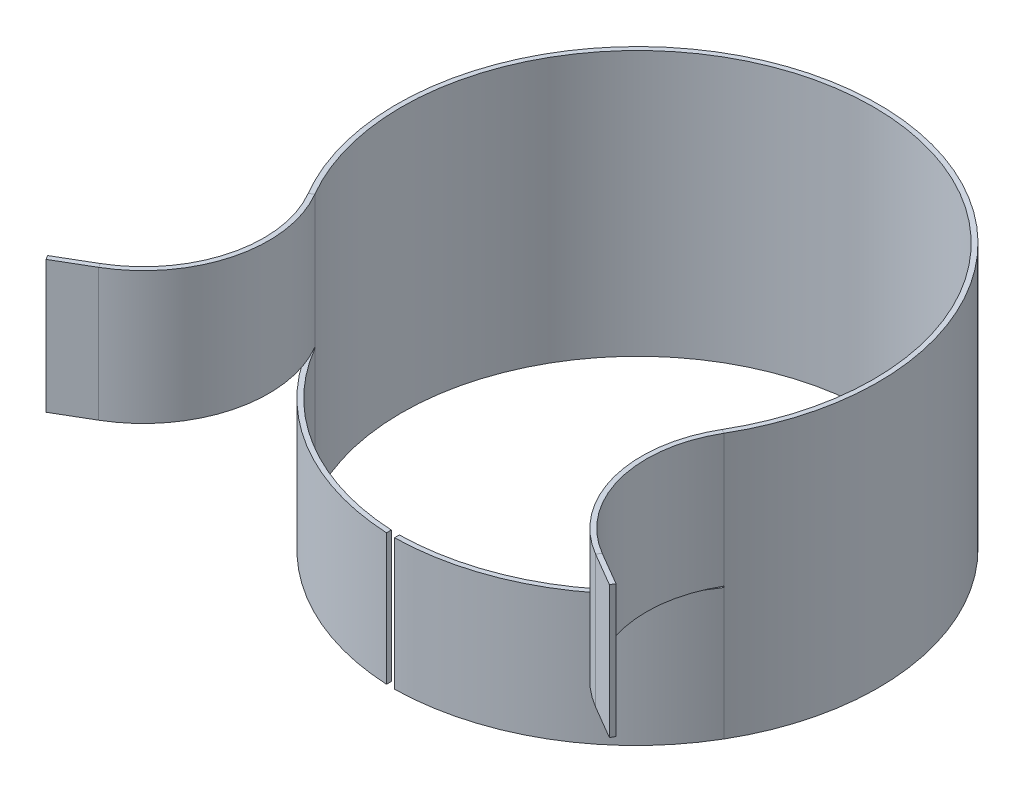
ISO-10303-21;
HEADER;
FILE_DESCRIPTION(('STEP AP214'),'2;1');
FILE_NAME('part.step','',(''),(''),'','','');
FILE_SCHEMA(('AUTOMOTIVE_DESIGN { 1 0 10303 214 1 1 1 1 }'));
ENDSEC;
DATA;
#1=APPLICATION_CONTEXT('core data for automotive mechanical design processes');
#2=APPLICATION_PROTOCOL_DEFINITION('international standard','automotive_design',2000,#1);
#3=PRODUCT_CONTEXT('',#1,'mechanical');
#4=PRODUCT('Part','Part','',(#3));
#5=PRODUCT_RELATED_PRODUCT_CATEGORY('part','',(#4));
#6=PRODUCT_DEFINITION_FORMATION('','',#4);
#7=PRODUCT_DEFINITION_CONTEXT('part definition',#1,'design');
#8=PRODUCT_DEFINITION('design','',#6,#7);
#9=PRODUCT_DEFINITION_SHAPE('','',#8);
#10=(LENGTH_UNIT() NAMED_UNIT(*) SI_UNIT(.MILLI.,.METRE.));
#11=(NAMED_UNIT(*) PLANE_ANGLE_UNIT() SI_UNIT($,.RADIAN.));
#12=(NAMED_UNIT(*) SI_UNIT($,.STERADIAN.) SOLID_ANGLE_UNIT());
#13=UNCERTAINTY_MEASURE_WITH_UNIT(LENGTH_MEASURE(1.E-05),#10,'distance_accuracy_value','');
#14=(GEOMETRIC_REPRESENTATION_CONTEXT(3) GLOBAL_UNCERTAINTY_ASSIGNED_CONTEXT((#13)) GLOBAL_UNIT_ASSIGNED_CONTEXT((#10,
#11,#12)) REPRESENTATION_CONTEXT('',''));
#15=CARTESIAN_POINT('',(0.,0.,0.));
#16=DIRECTION('',(0.,0.,1.));
#17=DIRECTION('',(1.,0.,0.));
#18=AXIS2_PLACEMENT_3D('',#15,#16,#17);
#19=CARTESIAN_POINT('',(86.3112091262845,55.0000000000016,50.5012393824001));
#20=DIRECTION('',(-0.505012393824022,0.,0.86311209126285));
#21=DIRECTION('',(0.,-1.,0.));
#22=AXIS2_PLACEMENT_3D('',#19,#20,#21);
#23=PLANE('',#22);
#24=DIRECTION('',(0.,-1.,0.));
#25=VECTOR('',#24,1.);
#26=CARTESIAN_POINT('',(86.3112091262845,110.000000000002,50.5012393824002));
#27=LINE('',#26,#25);
#28=CARTESIAN_POINT('',(86.3112091262843,55.0000000000018,50.5012393823993));
#29=VERTEX_POINT('',#28);
#30=CARTESIAN_POINT('',(86.3112091262845,54.5000000000016,50.5012393824001));
#31=VERTEX_POINT('',#30);
#32=EDGE_CURVE('E168',#29,#31,#27,.T.);
#33=ORIENTED_EDGE('',*,*,#32,.F.);
#34=DIRECTION('',(-0.863112091262865,0.,-0.505012393823997));
#35=VECTOR('',#34,1.);
#36=CARTESIAN_POINT('',(86.3112091262836,55.0000000000016,50.5012393823989));
#37=LINE('',#36,#35);
#38=CARTESIAN_POINT('',(84.584984943759,55.0000000000016,49.4912145947519));
#39=VERTEX_POINT('',#38);
#40=EDGE_CURVE('E335',#29,#39,#37,.T.);
#41=ORIENTED_EDGE('',*,*,#40,.T.);
#42=DIRECTION('',(0.,-1.,0.));
#43=VECTOR('',#42,1.);
#44=CARTESIAN_POINT('',(84.5849849437588,486.827992081348,49.4912145947521));
#45=LINE('',#44,#43);
#46=CARTESIAN_POINT('',(84.5849849437572,54.5000000000015,49.4912145947501));
#47=VERTEX_POINT('',#46);
#48=EDGE_CURVE('E146',#39,#47,#45,.T.);
#49=ORIENTED_EDGE('',*,*,#48,.T.);
#50=DIRECTION('',(0.863112091262865,0.,0.505012393823997));
#51=VECTOR('',#50,1.);
#52=CARTESIAN_POINT('',(84.584984943757,54.5000000000016,49.4912145947504));
#53=LINE('',#52,#51);
#54=EDGE_CURVE('E444',#47,#31,#53,.T.);
#55=ORIENTED_EDGE('',*,*,#54,.T.);
#56=EDGE_LOOP('',(#33,#41,#49,#55));
#57=FACE_BOUND('',#56,.T.);
#58=ADVANCED_FACE('F142',(#57),#23,.T.);
#59=CARTESIAN_POINT('',(-117.015962670786,55.,128.713886120455));
#60=DIRECTION('',(0.863112091262855,0.,-0.505012393824015));
#61=DIRECTION('',(-0.505012393824015,0.,-0.863112091262855));
#62=AXIS2_PLACEMENT_3D('',#59,#60,#61);
#63=PLANE('',#62);
#64=DIRECTION('',(0.,1.,0.));
#65=VECTOR('',#64,1.);
#66=CARTESIAN_POINT('',(-118.025987458434,55.,126.987661937929));
#67=LINE('',#66,#65);
#68=CARTESIAN_POINT('',(-118.025987458434,110.,126.987661937929));
#69=VERTEX_POINT('',#68);
#70=CARTESIAN_POINT('',(-118.025987458434,55.,126.987661937929));
#71=VERTEX_POINT('',#70);
#72=EDGE_CURVE('E541',#69,#71,#67,.F.);
#73=ORIENTED_EDGE('',*,*,#72,.T.);
#74=DIRECTION('',(-0.505012393824015,0.,-0.863112091262855));
#75=VECTOR('',#74,1.);
#76=CARTESIAN_POINT('',(-117.015962670786,55.,128.713886120455));
#77=LINE('',#76,#75);
#78=CARTESIAN_POINT('',(-117.015962670786,55.,128.713886120455));
#79=VERTEX_POINT('',#78);
#80=EDGE_CURVE('E532',#79,#71,#77,.T.);
#81=ORIENTED_EDGE('',*,*,#80,.F.);
#82=DIRECTION('',(0.,-1.,0.));
#83=VECTOR('',#82,1.);
#84=CARTESIAN_POINT('',(-117.015962670786,0.,128.713886120455));
#85=LINE('',#84,#83);
#86=CARTESIAN_POINT('',(-117.015962670786,110.,128.713886120455));
#87=VERTEX_POINT('',#86);
#88=EDGE_CURVE('E525',#87,#79,#85,.T.);
#89=ORIENTED_EDGE('',*,*,#88,.F.);
#90=DIRECTION('',(-0.505012393824015,0.,-0.863112091262855));
#91=VECTOR('',#90,1.);
#92=CARTESIAN_POINT('',(-117.015962670786,110.,128.713886120455));
#93=LINE('',#92,#91);
#94=EDGE_CURVE('E538',#87,#69,#93,.T.);
#95=ORIENTED_EDGE('',*,*,#94,.T.);
#96=EDGE_LOOP('',(#73,#81,#89,#95));
#97=FACE_BOUND('',#96,.T.);
#98=ADVANCED_FACE('F585',(#97),#63,.F.);
#99=CARTESIAN_POINT('',(25.2506196912003,0.,43.1556045631424));
#100=DIRECTION('',(-0.505012393824015,0.,-0.863112091262855));
#101=DIRECTION('',(-0.863112091262855,0.,0.505012393824015));
#102=AXIS2_PLACEMENT_3D('',#99,#100,#101);
#103=PLANE('',#102);
#104=DIRECTION('',(0.863112091262855,0.,-0.505012393824015));
#105=VECTOR('',#104,1.);
#106=CARTESIAN_POINT('',(-118.025987458434,110.,126.987661937929));
#107=LINE('',#106,#105);
#108=CARTESIAN_POINT('',(-104.216193998228,110.,118.907463636744));
#109=VERTEX_POINT('',#108);
#110=EDGE_CURVE('E519',#109,#69,#107,.F.);
#111=ORIENTED_EDGE('',*,*,#110,.F.);
#112=DIRECTION('',(0.,1.,0.));
#113=VECTOR('',#112,1.);
#114=CARTESIAN_POINT('',(-104.216193998228,55.,118.907463636744));
#115=LINE('',#114,#113);
#116=CARTESIAN_POINT('',(-104.216193998228,55.,118.907463636744));
#117=VERTEX_POINT('',#116);
#118=EDGE_CURVE('E515',#117,#109,#115,.T.);
#119=ORIENTED_EDGE('',*,*,#118,.F.);
#120=DIRECTION('',(-0.863112091262855,0.,0.505012393824015));
#121=VECTOR('',#120,1.);
#122=CARTESIAN_POINT('',(-61.0605894350851,55.,93.6568439455438));
#123=LINE('',#122,#121);
#124=EDGE_CURVE('E529',#71,#117,#123,.F.);
#125=ORIENTED_EDGE('',*,*,#124,.F.);
#126=ORIENTED_EDGE('',*,*,#72,.F.);
#127=EDGE_LOOP('',(#111,#119,#125,#126));
#128=FACE_BOUND('',#127,.T.);
#129=ADVANCED_FACE('F612',(#128),#103,.T.);
#130=CARTESIAN_POINT('',(-60.0505646474371,55.,95.3830681280695));
#131=DIRECTION('',(0.,1.,0.));
#132=DIRECTION('',(0.,0.,1.));
#133=AXIS2_PLACEMENT_3D('',#130,#131,#132);
#134=PLANE('',#133);
#135=DIRECTION('',(0.505012393824015,0.,0.863112091262855));
#136=VECTOR('',#135,1.);
#137=CARTESIAN_POINT('',(-103.20616921058,55.,120.63368781927));
#138=LINE('',#137,#136);
#139=CARTESIAN_POINT('',(-103.20616921058,55.,120.63368781927));
#140=VERTEX_POINT('',#139);
#141=EDGE_CURVE('E535',#117,#140,#138,.T.);
#142=ORIENTED_EDGE('',*,*,#141,.T.);
#143=DIRECTION('',(0.863112091262855,0.,-0.505012393824015));
#144=VECTOR('',#143,1.);
#145=CARTESIAN_POINT('',(26.2606444788484,55.,44.8818287456681));
#146=LINE('',#145,#144);
#147=EDGE_CURVE('E522',#79,#140,#146,.T.);
#148=ORIENTED_EDGE('',*,*,#147,.F.);
#149=ORIENTED_EDGE('',*,*,#80,.T.);
#150=ORIENTED_EDGE('',*,*,#124,.T.);
#151=EDGE_LOOP('',(#142,#148,#149,#150));
#152=FACE_BOUND('',#151,.T.);
#153=ADVANCED_FACE('F616',(#152),#134,.F.);
#154=CARTESIAN_POINT('',(26.2606444788484,0.,44.8818287456681));
#155=DIRECTION('',(-0.505012393824015,0.,-0.863112091262855));
#156=DIRECTION('',(-0.863112091262855,0.,0.505012393824015));
#157=AXIS2_PLACEMENT_3D('',#154,#155,#156);
#158=PLANE('',#157);
#159=DIRECTION('',(0.,-1.,0.));
#160=VECTOR('',#159,1.);
#161=CARTESIAN_POINT('',(-103.20616921058,55.,120.63368781927));
#162=LINE('',#161,#160);
#163=CARTESIAN_POINT('',(-103.20616921058,110.,120.63368781927));
#164=VERTEX_POINT('',#163);
#165=EDGE_CURVE('E543',#164,#140,#162,.T.);
#166=ORIENTED_EDGE('',*,*,#165,.F.);
#167=DIRECTION('',(-0.863112091262855,0.,0.505012393824015));
#168=VECTOR('',#167,1.);
#169=CARTESIAN_POINT('',(26.2606444788484,110.,44.8818287456681));
#170=LINE('',#169,#168);
#171=EDGE_CURVE('E527',#164,#87,#170,.T.);
#172=ORIENTED_EDGE('',*,*,#171,.T.);
#173=ORIENTED_EDGE('',*,*,#88,.T.);
#174=ORIENTED_EDGE('',*,*,#147,.T.);
#175=EDGE_LOOP('',(#166,#172,#173,#174));
#176=FACE_BOUND('',#175,.T.);
#177=ADVANCED_FACE('F619',(#176),#158,.F.);
#178=CARTESIAN_POINT('',(-117.015962670786,110.,128.713886120455));
#179=DIRECTION('',(0.,-1.,0.));
#180=DIRECTION('',(0.,0.,-1.));
#181=AXIS2_PLACEMENT_3D('',#178,#179,#180);
#182=PLANE('',#181);
#183=DIRECTION('',(0.505012393824015,0.,0.863112091262855));
#184=VECTOR('',#183,1.);
#185=CARTESIAN_POINT('',(-104.216193998228,110.,118.907463636744));
#186=LINE('',#185,#184);
#187=EDGE_CURVE('E546',#109,#164,#186,.T.);
#188=ORIENTED_EDGE('',*,*,#187,.F.);
#189=ORIENTED_EDGE('',*,*,#110,.T.);
#190=ORIENTED_EDGE('',*,*,#94,.F.);
#191=ORIENTED_EDGE('',*,*,#171,.F.);
#192=EDGE_LOOP('',(#188,#189,#190,#191));
#193=FACE_BOUND('',#192,.T.);
#194=ADVANCED_FACE('F144',(#193),#182,.F.);
#195=CARTESIAN_POINT('',(-129.466813689428,110.,75.7518590736017));
#196=DIRECTION('',(0.,-1.,0.));
#197=DIRECTION('',(0.,0.,-1.));
#198=AXIS2_PLACEMENT_3D('',#195,#196,#197);
#199=PLANE('',#198);
#200=ORIENTED_EDGE('',*,*,#187,.T.);
#201=CARTESIAN_POINT('',(-129.466813689428,110.,75.7518590736017));
#202=DIRECTION('',(0.,-1.,0.));
#203=DIRECTION('',(0.,0.,-1.));
#204=AXIS2_PLACEMENT_3D('',#201,#202,#203);
#205=CIRCLE('',#204,52.);
#206=CARTESIAN_POINT('',(-84.5849849437599,110.,49.491214594752));
#207=VERTEX_POINT('',#206);
#208=EDGE_CURVE('E501',#164,#207,#205,.F.);
#209=ORIENTED_EDGE('',*,*,#208,.T.);
#210=DIRECTION('',(-0.863112091262851,0.,0.505012393824021));
#211=VECTOR('',#210,1.);
#212=CARTESIAN_POINT('',(-84.5849849437599,110.,49.491214594752));
#213=LINE('',#212,#211);
#214=CARTESIAN_POINT('',(-86.3112091262856,110.,50.5012393824));
#215=VERTEX_POINT('',#214);
#216=EDGE_CURVE('E551',#207,#215,#213,.T.);
#217=ORIENTED_EDGE('',*,*,#216,.T.);
#218=CARTESIAN_POINT('',(-129.466813689428,110.,75.7518590736017));
#219=DIRECTION('',(0.,1.,0.));
#220=DIRECTION('',(0.,0.,1.));
#221=AXIS2_PLACEMENT_3D('',#218,#219,#220);
#222=CIRCLE('',#221,50.);
#223=EDGE_CURVE('E508',#109,#215,#222,.T.);
#224=ORIENTED_EDGE('',*,*,#223,.F.);
#225=EDGE_LOOP('',(#200,#209,#217,#224));
#226=FACE_BOUND('',#225,.T.);
#227=ADVANCED_FACE('F603',(#226),#199,.F.);
#228=CARTESIAN_POINT('',(-129.466813689428,55.,75.7518590736017));
#229=DIRECTION('',(0.,1.,0.));
#230=DIRECTION('',(0.,0.,1.));
#231=AXIS2_PLACEMENT_3D('',#228,#229,#230);
#232=PLANE('',#231);
#233=CARTESIAN_POINT('',(-129.466813689428,55.,75.7518590736017));
#234=DIRECTION('',(0.,-1.,0.));
#235=DIRECTION('',(0.,0.,-1.));
#236=AXIS2_PLACEMENT_3D('',#233,#234,#235);
#237=CIRCLE('',#236,52.);
#238=CARTESIAN_POINT('',(-84.5849849437604,55.,49.4912145947523));
#239=VERTEX_POINT('',#238);
#240=EDGE_CURVE('E512',#239,#140,#237,.T.);
#241=ORIENTED_EDGE('',*,*,#240,.T.);
#242=ORIENTED_EDGE('',*,*,#141,.F.);
#243=CARTESIAN_POINT('',(-129.466813689428,55.,75.7518590736017));
#244=DIRECTION('',(0.,-1.,0.));
#245=DIRECTION('',(0.,0.,-1.));
#246=AXIS2_PLACEMENT_3D('',#243,#244,#245);
#247=CIRCLE('',#246,50.);
#248=CARTESIAN_POINT('',(-86.3112091262856,55.,50.5012393824));
#249=VERTEX_POINT('',#248);
#250=EDGE_CURVE('E511',#249,#117,#247,.T.);
#251=ORIENTED_EDGE('',*,*,#250,.F.);
#252=DIRECTION('',(0.863112091262851,0.,-0.505012393824021));
#253=VECTOR('',#252,1.);
#254=CARTESIAN_POINT('',(-86.3112091262861,55.,50.5012393824003));
#255=LINE('',#254,#253);
#256=EDGE_CURVE('E14',#249,#239,#255,.T.);
#257=ORIENTED_EDGE('',*,*,#256,.T.);
#258=EDGE_LOOP('',(#241,#242,#251,#257));
#259=FACE_BOUND('',#258,.T.);
#260=ADVANCED_FACE('F598',(#259),#232,.F.);
#261=CARTESIAN_POINT('',(-129.466813689428,181.120792172754,75.7518590736017));
#262=DIRECTION('',(0.,-1.,0.));
#263=DIRECTION('',(0.,0.,-1.));
#264=AXIS2_PLACEMENT_3D('',#261,#262,#263);
#265=CYLINDRICAL_SURFACE('',#264,50.);
#266=DIRECTION('',(0.,-1.,0.));
#267=VECTOR('',#266,1.);
#268=CARTESIAN_POINT('',(-86.3112091262856,110.,50.5012393824));
#269=LINE('',#268,#267);
#270=EDGE_CURVE('E521',#215,#249,#269,.T.);
#271=ORIENTED_EDGE('',*,*,#270,.T.);
#272=ORIENTED_EDGE('',*,*,#250,.T.);
#273=ORIENTED_EDGE('',*,*,#118,.T.);
#274=ORIENTED_EDGE('',*,*,#223,.T.);
#275=EDGE_LOOP('',(#271,#272,#273,#274));
#276=FACE_BOUND('',#275,.T.);
#277=ADVANCED_FACE('F595',(#276),#265,.F.);
#278=CARTESIAN_POINT('',(-129.466813689428,181.120792172754,75.7518590736017));
#279=DIRECTION('',(0.,-1.,0.));
#280=DIRECTION('',(0.,0.,-1.));
#281=AXIS2_PLACEMENT_3D('',#278,#279,#280);
#282=CYLINDRICAL_SURFACE('',#281,52.);
#283=DIRECTION('',(0.,-1.,0.));
#284=VECTOR('',#283,1.);
#285=CARTESIAN_POINT('',(-84.5849849437599,110.,49.491214594752));
#286=LINE('',#285,#284);
#287=EDGE_CURVE('E152',#207,#239,#286,.T.);
#288=ORIENTED_EDGE('',*,*,#287,.F.);
#289=ORIENTED_EDGE('',*,*,#208,.F.);
#290=ORIENTED_EDGE('',*,*,#165,.T.);
#291=ORIENTED_EDGE('',*,*,#240,.F.);
#292=EDGE_LOOP('',(#288,#289,#290,#291));
#293=FACE_BOUND('',#292,.T.);
#294=ADVANCED_FACE('F593',(#293),#282,.T.);
#295=CARTESIAN_POINT('',(-86.3112091262856,55.0000000000013,50.5012393824));
#296=DIRECTION('',(0.505012393824022,0.,0.863112091262851));
#297=DIRECTION('',(0.,1.,0.));
#298=AXIS2_PLACEMENT_3D('',#295,#296,#297);
#299=PLANE('',#298);
#300=DIRECTION('',(-0.863112091262851,0.,0.505012393824021));
#301=VECTOR('',#300,1.);
#302=CARTESIAN_POINT('',(-84.5849849437613,54.5000000000005,49.4912145947528));
#303=LINE('',#302,#301);
#304=CARTESIAN_POINT('',(-84.5849849437599,54.5000000000004,49.491214594752));
#305=VERTEX_POINT('',#304);
#306=CARTESIAN_POINT('',(-86.311209126287,54.5000000000002,50.5012393824009));
#307=VERTEX_POINT('',#306);
#308=EDGE_CURVE('E460',#305,#307,#303,.T.);
#309=ORIENTED_EDGE('',*,*,#308,.F.);
#310=DIRECTION('',(0.,-1.,0.));
#311=VECTOR('',#310,1.);
#312=CARTESIAN_POINT('',(-84.5849849437599,486.827992081348,49.491214594752));
#313=LINE('',#312,#311);
#314=EDGE_CURVE('E495',#305,#239,#313,.F.);
#315=ORIENTED_EDGE('',*,*,#314,.T.);
#316=ORIENTED_EDGE('',*,*,#256,.F.);
#317=DIRECTION('',(0.,1.,0.));
#318=VECTOR('',#317,1.);
#319=CARTESIAN_POINT('',(-86.3112091262856,110.,50.5012393824));
#320=LINE('',#319,#318);
#321=EDGE_CURVE('E500',#307,#249,#320,.T.);
#322=ORIENTED_EDGE('',*,*,#321,.F.);
#323=EDGE_LOOP('',(#309,#315,#316,#322));
#324=FACE_BOUND('',#323,.T.);
#325=ADVANCED_FACE('F589',(#324),#299,.T.);
#326=CARTESIAN_POINT('',(-4.9960036108132E-13,110.000000000001,-2.1094237467878E-12));
#327=DIRECTION('',(0.,1.,0.));
#328=DIRECTION('',(-1.,0.,0.));
#329=AXIS2_PLACEMENT_3D('',#326,#327,#328);
#330=PLANE('',#329);
#331=ORIENTED_EDGE('',*,*,#216,.F.);
#332=CARTESIAN_POINT('',(-4.9960036108132E-13,110.,-2.1094237467878E-12));
#333=DIRECTION('',(0.,-1.,0.));
#334=DIRECTION('',(0.,0.,-1.));
#335=AXIS2_PLACEMENT_3D('',#332,#333,#334);
#336=CIRCLE('',#335,98.);
#337=CARTESIAN_POINT('',(84.5849849437587,110.000000000002,49.4912145947511));
#338=VERTEX_POINT('',#337);
#339=EDGE_CURVE('E463',#207,#338,#336,.T.);
#340=ORIENTED_EDGE('',*,*,#339,.T.);
#341=DIRECTION('',(-0.863112091262865,0.,-0.505012393823997));
#342=VECTOR('',#341,1.);
#343=CARTESIAN_POINT('',(86.3112091262844,110.000000000002,50.5012393823993));
#344=LINE('',#343,#342);
#345=CARTESIAN_POINT('',(86.3112091262845,110.000000000002,50.5012393823991));
#346=VERTEX_POINT('',#345);
#347=EDGE_CURVE('E647',#346,#338,#344,.T.);
#348=ORIENTED_EDGE('',*,*,#347,.F.);
#349=CARTESIAN_POINT('',(-4.9960036108132E-13,110.000000000001,-2.1094237467878E-12));
#350=DIRECTION('',(0.,-1.,0.));
#351=DIRECTION('',(1.,0.,0.));
#352=AXIS2_PLACEMENT_3D('',#349,#350,#351);
#353=CIRCLE('',#352,100.);
#354=EDGE_CURVE('E492',#215,#346,#353,.T.);
#355=ORIENTED_EDGE('',*,*,#354,.F.);
#356=EDGE_LOOP('',(#331,#340,#348,#355));
#357=FACE_BOUND('',#356,.T.);
#358=ADVANCED_FACE('F581',(#357),#330,.T.);
#359=CARTESIAN_POINT('',(-4.9960036108132E-13,2.59854773864164E-12,-2.1094237467878E-12));
#360=DIRECTION('',(0.,-1.,0.));
#361=DIRECTION('',(0.,0.,-1.));
#362=AXIS2_PLACEMENT_3D('',#359,#360,#361);
#363=PLANE('',#362);
#364=DIRECTION('',(-0.863112091262865,0.,-0.505012393823997));
#365=VECTOR('',#364,1.);
#366=CARTESIAN_POINT('',(86.3112091262843,1.54421758856855E-12,50.5012393823993));
#367=LINE('',#366,#365);
#368=CARTESIAN_POINT('',(86.3112091262828,1.53235504688997E-12,50.5012393823983));
#369=VERTEX_POINT('',#368);
#370=CARTESIAN_POINT('',(84.5849849437571,1.54428608597558E-12,49.4912145947504));
#371=VERTEX_POINT('',#370);
#372=EDGE_CURVE('E452',#369,#371,#367,.T.);
#373=ORIENTED_EDGE('',*,*,#372,.T.);
#374=CARTESIAN_POINT('',(-4.9960036108132E-13,1.55431223447522E-12,-2.1094237467878E-12));
#375=DIRECTION('',(0.,-1.,0.));
#376=DIRECTION('',(0.,0.,-1.));
#377=AXIS2_PLACEMENT_3D('',#374,#375,#376);
#378=CIRCLE('',#377,98.);
#379=CARTESIAN_POINT('',(-84.5849849437599,1.55431223447522E-12,49.491214594752));
#380=VERTEX_POINT('',#379);
#381=EDGE_CURVE('E507',#371,#380,#378,.F.);
#382=ORIENTED_EDGE('',*,*,#381,.T.);
#383=DIRECTION('',(-0.863112091262851,0.,0.505012393824021));
#384=VECTOR('',#383,1.);
#385=CARTESIAN_POINT('',(-84.5849849437599,0.,49.491214594752));
#386=LINE('',#385,#384);
#387=CARTESIAN_POINT('',(-86.3112091262856,2.59217919076181E-12,50.5012393824));
#388=VERTEX_POINT('',#387);
#389=EDGE_CURVE('E489',#380,#388,#386,.T.);
#390=ORIENTED_EDGE('',*,*,#389,.T.);
#391=CARTESIAN_POINT('',(-4.9960036108132E-13,2.59854773864164E-12,-2.1094237467878E-12));
#392=DIRECTION('',(0.,1.,0.));
#393=DIRECTION('',(0.,0.,1.));
#394=AXIS2_PLACEMENT_3D('',#391,#392,#393);
#395=CIRCLE('',#394,100.);
#396=EDGE_CURVE('E497',#369,#388,#395,.T.);
#397=ORIENTED_EDGE('',*,*,#396,.F.);
#398=EDGE_LOOP('',(#373,#382,#390,#397));
#399=FACE_BOUND('',#398,.T.);
#400=ADVANCED_FACE('F578',(#399),#363,.T.);
#401=CARTESIAN_POINT('',(-4.9960036108132E-13,486.827992081348,-2.1094237467878E-12));
#402=DIRECTION('',(0.,-1.,0.));
#403=DIRECTION('',(0.,0.,-1.));
#404=AXIS2_PLACEMENT_3D('',#401,#402,#403);
#405=CYLINDRICAL_SURFACE('',#404,100.);
#406=ORIENTED_EDGE('',*,*,#396,.T.);
#407=DIRECTION('',(0.,1.,0.));
#408=VECTOR('',#407,1.);
#409=CARTESIAN_POINT('',(-86.3112091262865,0.,50.5012393824006));
#410=LINE('',#409,#408);
#411=EDGE_CURVE('E422',#388,#307,#410,.T.);
#412=ORIENTED_EDGE('',*,*,#411,.T.);
#413=ORIENTED_EDGE('',*,*,#321,.T.);
#414=ORIENTED_EDGE('',*,*,#270,.F.);
#415=ORIENTED_EDGE('',*,*,#354,.T.);
#416=DIRECTION('',(0.,-1.,0.));
#417=VECTOR('',#416,1.);
#418=CARTESIAN_POINT('',(86.3112091262844,110.000000000002,50.5012393823993));
#419=LINE('',#418,#417);
#420=EDGE_CURVE('E319',#346,#29,#419,.T.);
#421=ORIENTED_EDGE('',*,*,#420,.T.);
#422=ORIENTED_EDGE('',*,*,#32,.T.);
#423=DIRECTION('',(0.,-1.,0.));
#424=VECTOR('',#423,1.);
#425=CARTESIAN_POINT('',(86.3112091262828,54.5000000000016,50.5012393823984));
#426=LINE('',#425,#424);
#427=EDGE_CURVE('E455',#31,#369,#426,.T.);
#428=ORIENTED_EDGE('',*,*,#427,.T.);
#429=EDGE_LOOP('',(#406,#412,#413,#414,#415,#421,#422,#428));
#430=FACE_BOUND('',#429,.T.);
#431=ADVANCED_FACE('F576',(#430),#405,.T.);
#432=CARTESIAN_POINT('',(-4.9960036108132E-13,486.827992081348,-2.1094237467878E-12));
#433=DIRECTION('',(0.,-1.,0.));
#434=DIRECTION('',(0.,0.,-1.));
#435=AXIS2_PLACEMENT_3D('',#432,#433,#434);
#436=CYLINDRICAL_SURFACE('',#435,98.);
#437=ORIENTED_EDGE('',*,*,#381,.F.);
#438=CARTESIAN_POINT('',(84.5849849437572,54.5000000000015,49.4912145947502));
#439=DIRECTION('',(0.,-1.,0.));
#440=VECTOR('',#439,1.);
#441=LINE('',#438,#440);
#442=EDGE_CURVE('E449',#47,#371,#441,.T.);
#443=ORIENTED_EDGE('',*,*,#442,.F.);
#444=ORIENTED_EDGE('',*,*,#48,.F.);
#445=DIRECTION('',(0.,-1.,0.));
#446=VECTOR('',#445,1.);
#447=CARTESIAN_POINT('',(84.5849849437586,110.000000000002,49.4912145947513));
#448=LINE('',#447,#446);
#449=EDGE_CURVE('E160',#338,#39,#448,.T.);
#450=ORIENTED_EDGE('',*,*,#449,.F.);
#451=ORIENTED_EDGE('',*,*,#339,.F.);
#452=ORIENTED_EDGE('',*,*,#287,.T.);
#453=ORIENTED_EDGE('',*,*,#314,.F.);
#454=DIRECTION('',(0.,1.,0.));
#455=VECTOR('',#454,1.);
#456=CARTESIAN_POINT('',(-84.5849849437608,0.,49.4912145947525));
#457=LINE('',#456,#455);
#458=EDGE_CURVE('E467',#380,#305,#457,.T.);
#459=ORIENTED_EDGE('',*,*,#458,.F.);
#460=EDGE_LOOP('',(#437,#443,#444,#450,#451,#452,#453,#459));
#461=FACE_BOUND('',#460,.T.);
#462=ADVANCED_FACE('F565',(#461),#436,.F.);
#463=CARTESIAN_POINT('',(-3.48265829042724,27.2500000000006,100.856886147074));
#464=DIRECTION('',(0.998695205242392,0.,0.0510674752250124));
#465=DIRECTION('',(0.,1.,0.));
#466=AXIS2_PLACEMENT_3D('',#463,#464,#465);
#467=PLANE('',#466);
#468=DIRECTION('',(0.,1.,0.));
#469=VECTOR('',#468,1.);
#470=CARTESIAN_POINT('',(-3.38052333997618,-88.1939208586948,98.8594957365891));
#471=LINE('',#470,#469);
#472=CARTESIAN_POINT('',(-3.38052333997699,4.85722573273506E-13,98.8594957365896));
#473=VERTEX_POINT('',#472);
#474=CARTESIAN_POINT('',(-3.38052333997746,54.500000000001,98.8594957365898));
#475=VERTEX_POINT('',#474);
#476=EDGE_CURVE('E486',#473,#475,#471,.T.);
#477=ORIENTED_EDGE('',*,*,#476,.T.);
#478=DIRECTION('',(-0.0510674752250107,0.,0.998695205242392));
#479=VECTOR('',#478,1.);
#480=CARTESIAN_POINT('',(-3.48265829042732,54.500000000001,100.856886147075));
#481=LINE('',#480,#479);
#482=CARTESIAN_POINT('',(-3.48265829042732,54.500000000001,100.856886147075));
#483=VERTEX_POINT('',#482);
#484=EDGE_CURVE('E484',#475,#483,#481,.T.);
#485=ORIENTED_EDGE('',*,*,#484,.T.);
#486=DIRECTION('',(0.,1.,0.));
#487=VECTOR('',#486,1.);
#488=CARTESIAN_POINT('',(-3.48265829042715,2.40409708356914E-13,100.856886147074));
#489=LINE('',#488,#487);
#490=CARTESIAN_POINT('',(-3.48265829042721,1.22790962966113E-13,100.856886147074));
#491=VERTEX_POINT('',#490);
#492=EDGE_CURVE('E478',#491,#483,#489,.T.);
#493=ORIENTED_EDGE('',*,*,#492,.F.);
#494=DIRECTION('',(-0.0510674752250144,0.,0.998695205242392));
#495=VECTOR('',#494,1.);
#496=CARTESIAN_POINT('',(-3.48265829042721,1.22790962966113E-13,100.856886147074));
#497=LINE('',#496,#495);
#498=EDGE_CURVE('E470',#473,#491,#497,.T.);
#499=ORIENTED_EDGE('',*,*,#498,.F.);
#500=EDGE_LOOP('',(#477,#485,#493,#499));
#501=FACE_BOUND('',#500,.T.);
#502=ADVANCED_FACE('F575',(#501),#467,.T.);
#503=CARTESIAN_POINT('',(1.72622418252505,-88.1939208586942,-1.01002478765008));
#504=DIRECTION('',(0.,1.,0.));
#505=DIRECTION('',(1.,0.,0.));
#506=AXIS2_PLACEMENT_3D('',#503,#504,#505);
#507=CYLINDRICAL_SURFACE('',#506,102.);
#508=CARTESIAN_POINT('',(1.72622418252422,1.06512021424975E-12,-1.01002478764959));
#509=DIRECTION('',(0.,1.,0.));
#510=DIRECTION('',(0.,0.,1.));
#511=AXIS2_PLACEMENT_3D('',#508,#509,#510);
#512=CIRCLE('',#511,102.);
#513=EDGE_CURVE('E481',#388,#491,#512,.T.);
#514=ORIENTED_EDGE('',*,*,#513,.T.);
#515=ORIENTED_EDGE('',*,*,#492,.T.);
#516=CARTESIAN_POINT('',(1.72622418252372,54.5000000000016,-1.0100247876493));
#517=DIRECTION('',(0.,-1.,0.));
#518=DIRECTION('',(-1.,0.,0.));
#519=AXIS2_PLACEMENT_3D('',#516,#517,#518);
#520=CIRCLE('',#519,102.);
#521=EDGE_CURVE('E475',#483,#307,#520,.T.);
#522=ORIENTED_EDGE('',*,*,#521,.T.);
#523=ORIENTED_EDGE('',*,*,#411,.F.);
#524=EDGE_LOOP('',(#514,#515,#522,#523));
#525=FACE_BOUND('',#524,.T.);
#526=ADVANCED_FACE('F671',(#525),#507,.T.);
#527=CARTESIAN_POINT('',(1.72622418252422,1.06512021424975E-12,-1.01002478764959));
#528=DIRECTION('',(0.,-1.,0.));
#529=DIRECTION('',(0.,0.,-1.));
#530=AXIS2_PLACEMENT_3D('',#527,#528,#529);
#531=PLANE('',#530);
#532=ORIENTED_EDGE('',*,*,#389,.F.);
#533=CARTESIAN_POINT('',(1.72622418252424,1.06858966120171E-12,-1.0100247876496));
#534=DIRECTION('',(0.,1.,0.));
#535=DIRECTION('',(1.,0.,0.));
#536=AXIS2_PLACEMENT_3D('',#533,#534,#535);
#537=CIRCLE('',#536,100.);
#538=EDGE_CURVE('E472',#380,#473,#537,.T.);
#539=ORIENTED_EDGE('',*,*,#538,.T.);
#540=ORIENTED_EDGE('',*,*,#498,.T.);
#541=ORIENTED_EDGE('',*,*,#513,.F.);
#542=EDGE_LOOP('',(#532,#539,#540,#541));
#543=FACE_BOUND('',#542,.T.);
#544=ADVANCED_FACE('F666',(#543),#531,.T.);
#545=CARTESIAN_POINT('',(1.72622418252505,-88.1939208586942,-1.01002478765008));
#546=DIRECTION('',(0.,1.,0.));
#547=DIRECTION('',(1.,0.,0.));
#548=AXIS2_PLACEMENT_3D('',#545,#546,#547);
#549=CYLINDRICAL_SURFACE('',#548,100.);
#550=ORIENTED_EDGE('',*,*,#538,.F.);
#551=ORIENTED_EDGE('',*,*,#458,.T.);
#552=CARTESIAN_POINT('',(1.72622418252377,54.5000000000016,-1.01002478764931));
#553=DIRECTION('',(0.,1.,0.));
#554=DIRECTION('',(1.,0.,0.));
#555=AXIS2_PLACEMENT_3D('',#552,#553,#554);
#556=CIRCLE('',#555,100.);
#557=EDGE_CURVE('E464',#475,#305,#556,.F.);
#558=ORIENTED_EDGE('',*,*,#557,.F.);
#559=ORIENTED_EDGE('',*,*,#476,.F.);
#560=EDGE_LOOP('',(#550,#551,#558,#559));
#561=FACE_BOUND('',#560,.T.);
#562=ADVANCED_FACE('F678',(#561),#549,.F.);
#563=CARTESIAN_POINT('',(1.72622418252372,54.5000000000016,-1.0100247876493));
#564=DIRECTION('',(0.,1.,0.));
#565=DIRECTION('',(1.,0.,0.));
#566=AXIS2_PLACEMENT_3D('',#563,#564,#565);
#567=PLANE('',#566);
#568=ORIENTED_EDGE('',*,*,#484,.F.);
#569=ORIENTED_EDGE('',*,*,#557,.T.);
#570=ORIENTED_EDGE('',*,*,#308,.T.);
#571=ORIENTED_EDGE('',*,*,#521,.F.);
#572=EDGE_LOOP('',(#568,#569,#570,#571));
#573=FACE_BOUND('',#572,.T.);
#574=ADVANCED_FACE('F360',(#573),#567,.T.);
#575=CARTESIAN_POINT('',(1.14380727112007E-10,5.67879727172525E-12,-222.840696626142));
#576=DIRECTION('',(1.,0.,3.64430707833208E-13));
#577=DIRECTION('',(3.64430707833208E-13,0.,-1.));
#578=AXIS2_PLACEMENT_3D('',#575,#576,#577);
#579=PLANE('',#578);
#580=DIRECTION('',(3.7425618160114E-13,0.,-1.));
#581=VECTOR('',#580,1.);
#582=CARTESIAN_POINT('',(-3.66373598126302E-12,54.5000000000016,100.975367058788));
#583=LINE('',#582,#581);
#584=CARTESIAN_POINT('',(-2.85882428840978E-12,54.5000000000015,98.9750748526037));
#585=VERTEX_POINT('',#584);
#586=CARTESIAN_POINT('',(-3.60822483003176E-12,54.5000000000015,100.975367058788));
#587=VERTEX_POINT('',#586);
#588=EDGE_CURVE('E427',#585,#587,#583,.F.);
#589=ORIENTED_EDGE('',*,*,#588,.F.);
#590=CARTESIAN_POINT('',(-2.8046141797855E-12,0.,98.9750748526036));
#591=DIRECTION('',(0.,1.,0.));
#592=VECTOR('',#591,1.);
#593=LINE('',#590,#592);
#594=CARTESIAN_POINT('',(-2.91433543964104E-12,1.55282397948707E-12,98.9750748526036));
#595=VERTEX_POINT('',#594);
#596=EDGE_CURVE('E342',#595,#585,#593,.T.);
#597=ORIENTED_EDGE('',*,*,#596,.F.);
#598=DIRECTION('',(3.64430707833208E-13,0.,-1.));
#599=VECTOR('',#598,1.);
#600=CARTESIAN_POINT('',(1.14380727112007E-10,1.59729211680886E-12,-222.840696626142));
#601=LINE('',#600,#599);
#602=CARTESIAN_POINT('',(-3.63598040564739E-12,1.55254936415028E-12,100.975367058788));
#603=VERTEX_POINT('',#602);
#604=EDGE_CURVE('E440',#595,#603,#601,.F.);
#605=ORIENTED_EDGE('',*,*,#604,.T.);
#606=CARTESIAN_POINT('',(-3.51953709232244E-12,54.5000000000015,100.975367058788));
#607=DIRECTION('',(0.,-1.,0.));
#608=VECTOR('',#607,1.);
#609=LINE('',#606,#608);
#610=EDGE_CURVE('E378',#587,#603,#609,.T.);
#611=ORIENTED_EDGE('',*,*,#610,.F.);
#612=EDGE_LOOP('',(#589,#597,#605,#611));
#613=FACE_BOUND('',#612,.T.);
#614=ADVANCED_FACE('F349',(#613),#579,.F.);
#615=CARTESIAN_POINT('',(-1.72622418252835,145.724434812475,-1.01002478765111));
#616=DIRECTION('',(0.,-1.,0.));
#617=DIRECTION('',(-0.871764606694213,0.,0.489924964168274));
#618=AXIS2_PLACEMENT_3D('',#615,#616,#617);
#619=CYLINDRICAL_SURFACE('',#618,102.);
#620=ORIENTED_EDGE('',*,*,#427,.F.);
#621=CARTESIAN_POINT('',(-1.72622418252835,54.500000000001,-1.01002478765105));
#622=DIRECTION('',(0.,-1.,0.));
#623=DIRECTION('',(0.871764606694213,0.,-0.489924964168274));
#624=AXIS2_PLACEMENT_3D('',#621,#622,#623);
#625=CIRCLE('',#624,102.);
#626=EDGE_CURVE('E438',#31,#587,#625,.T.);
#627=ORIENTED_EDGE('',*,*,#626,.T.);
#628=ORIENTED_EDGE('',*,*,#610,.T.);
#629=CARTESIAN_POINT('',(-1.72622418252841,1.01892055226099E-12,-1.01002478765111));
#630=DIRECTION('',(0.,1.,0.));
#631=DIRECTION('',(-0.871764606694213,0.,0.489924964168274));
#632=AXIS2_PLACEMENT_3D('',#629,#630,#631);
#633=CIRCLE('',#632,102.);
#634=EDGE_CURVE('E432',#603,#369,#633,.T.);
#635=ORIENTED_EDGE('',*,*,#634,.T.);
#636=EDGE_LOOP('',(#620,#627,#628,#635));
#637=FACE_BOUND('',#636,.T.);
#638=ADVANCED_FACE('F359',(#637),#619,.T.);
#639=CARTESIAN_POINT('',(-1.72622418252835,54.500000000001,-1.01002478765105));
#640=DIRECTION('',(0.,1.,0.));
#641=DIRECTION('',(0.871764606694213,0.,-0.489924964168274));
#642=AXIS2_PLACEMENT_3D('',#639,#640,#641);
#643=PLANE('',#642);
#644=ORIENTED_EDGE('',*,*,#588,.T.);
#645=ORIENTED_EDGE('',*,*,#626,.F.);
#646=ORIENTED_EDGE('',*,*,#54,.F.);
#647=CARTESIAN_POINT('',(-1.72622418252835,54.5000000000016,-1.01002478765111));
#648=DIRECTION('',(0.,-1.,0.));
#649=DIRECTION('',(-0.871764606694213,0.,0.489924964168274));
#650=AXIS2_PLACEMENT_3D('',#647,#648,#649);
#651=CIRCLE('',#650,100.);
#652=EDGE_CURVE('E425',#47,#585,#651,.T.);
#653=ORIENTED_EDGE('',*,*,#652,.T.);
#654=EDGE_LOOP('',(#644,#645,#646,#653));
#655=FACE_BOUND('',#654,.T.);
#656=ADVANCED_FACE('F409',(#655),#643,.T.);
#657=CARTESIAN_POINT('',(-1.72622418252835,145.724434812475,-1.01002478765111));
#658=DIRECTION('',(0.,-1.,0.));
#659=DIRECTION('',(-0.871764606694213,0.,0.489924964168274));
#660=AXIS2_PLACEMENT_3D('',#657,#658,#659);
#661=CYLINDRICAL_SURFACE('',#660,100.);
#662=CARTESIAN_POINT('',(-1.72622418252841,1.56709317066968E-12,-1.01002478765111));
#663=DIRECTION('',(0.,-1.,0.));
#664=DIRECTION('',(-0.871764606694213,0.,0.489924964168274));
#665=AXIS2_PLACEMENT_3D('',#662,#663,#664);
#666=CIRCLE('',#665,100.);
#667=EDGE_CURVE('E415',#595,#371,#666,.F.);
#668=ORIENTED_EDGE('',*,*,#667,.F.);
#669=ORIENTED_EDGE('',*,*,#596,.T.);
#670=ORIENTED_EDGE('',*,*,#652,.F.);
#671=ORIENTED_EDGE('',*,*,#442,.T.);
#672=EDGE_LOOP('',(#668,#669,#670,#671));
#673=FACE_BOUND('',#672,.T.);
#674=ADVANCED_FACE('F399',(#673),#661,.F.);
#675=CARTESIAN_POINT('',(-1.72622418252841,1.01892055226099E-12,-1.01002478765111));
#676=DIRECTION('',(0.,-1.,0.));
#677=DIRECTION('',(-0.871764606694213,0.,0.489924964168274));
#678=AXIS2_PLACEMENT_3D('',#675,#676,#677);
#679=PLANE('',#678);
#680=ORIENTED_EDGE('',*,*,#604,.F.);
#681=ORIENTED_EDGE('',*,*,#667,.T.);
#682=ORIENTED_EDGE('',*,*,#372,.F.);
#683=ORIENTED_EDGE('',*,*,#634,.F.);
#684=EDGE_LOOP('',(#680,#681,#682,#683));
#685=FACE_BOUND('',#684,.T.);
#686=ADVANCED_FACE('F408',(#685),#679,.T.);
#687=CARTESIAN_POINT('',(117.015962670784,110.000000000002,128.713886120451));
#688=DIRECTION('',(-0.863112091262855,0.,-0.505012393824015));
#689=DIRECTION('',(-0.505012393824015,0.,0.863112091262855));
#690=AXIS2_PLACEMENT_3D('',#687,#688,#689);
#691=PLANE('',#690);
#692=DIRECTION('',(0.,-1.,0.));
#693=VECTOR('',#692,1.);
#694=CARTESIAN_POINT('',(118.025987458432,110.000000000002,126.987661937926));
#695=LINE('',#694,#693);
#696=CARTESIAN_POINT('',(118.025987458432,55.0000000000016,126.987661937926));
#697=VERTEX_POINT('',#696);
#698=CARTESIAN_POINT('',(118.025987458432,110.000000000002,126.987661937926));
#699=VERTEX_POINT('',#698);
#700=EDGE_CURVE('E333',#697,#699,#695,.F.);
#701=ORIENTED_EDGE('',*,*,#700,.T.);
#702=DIRECTION('',(0.505012393824015,0.,-0.863112091262855));
#703=VECTOR('',#702,1.);
#704=CARTESIAN_POINT('',(117.015962670784,110.000000000002,128.713886120451));
#705=LINE('',#704,#703);
#706=CARTESIAN_POINT('',(117.015962670784,110.000000000002,128.713886120451));
#707=VERTEX_POINT('',#706);
#708=EDGE_CURVE('E307',#707,#699,#705,.T.);
#709=ORIENTED_EDGE('',*,*,#708,.F.);
#710=DIRECTION('',(0.,1.,0.));
#711=VECTOR('',#710,1.);
#712=CARTESIAN_POINT('',(117.015962670784,1.54350559406091E-12,128.713886120451));
#713=LINE('',#712,#711);
#714=CARTESIAN_POINT('',(117.015962670784,55.0000000000016,128.713886120451));
#715=VERTEX_POINT('',#714);
#716=EDGE_CURVE('E325',#715,#707,#713,.T.);
#717=ORIENTED_EDGE('',*,*,#716,.F.);
#718=DIRECTION('',(0.505012393824015,0.,-0.863112091262855));
#719=VECTOR('',#718,1.);
#720=CARTESIAN_POINT('',(117.015962670784,55.0000000000016,128.713886120451));
#721=LINE('',#720,#719);
#722=EDGE_CURVE('E330',#715,#697,#721,.T.);
#723=ORIENTED_EDGE('',*,*,#722,.T.);
#724=EDGE_LOOP('',(#701,#709,#717,#723));
#725=FACE_BOUND('',#724,.T.);
#726=ADVANCED_FACE('F747',(#725),#691,.F.);
#727=CARTESIAN_POINT('',(117.015962670784,55.0000000000016,128.713886120451));
#728=DIRECTION('',(0.,1.,0.));
#729=DIRECTION('',(-1.,0.,0.));
#730=AXIS2_PLACEMENT_3D('',#727,#728,#729);
#731=PLANE('',#730);
#732=DIRECTION('',(-0.505012393824015,0.,0.863112091262855));
#733=VECTOR('',#732,1.);
#734=CARTESIAN_POINT('',(104.216193998227,55.0000000000016,118.907463636741));
#735=LINE('',#734,#733);
#736=CARTESIAN_POINT('',(104.216193998226,55.0000000000016,118.907463636743));
#737=VERTEX_POINT('',#736);
#738=CARTESIAN_POINT('',(103.206169210578,55.0000000000016,120.633687819267));
#739=VERTEX_POINT('',#738);
#740=EDGE_CURVE('E987',#737,#739,#735,.T.);
#741=ORIENTED_EDGE('',*,*,#740,.F.);
#742=DIRECTION('',(-0.863112091262855,0.,-0.505012393824015));
#743=VECTOR('',#742,1.);
#744=CARTESIAN_POINT('',(118.025987458432,55.0000000000016,126.987661937926));
#745=LINE('',#744,#743);
#746=EDGE_CURVE('E291',#737,#697,#745,.F.);
#747=ORIENTED_EDGE('',*,*,#746,.T.);
#748=ORIENTED_EDGE('',*,*,#722,.F.);
#749=DIRECTION('',(0.863112091262855,0.,0.505012393824015));
#750=VECTOR('',#749,1.);
#751=CARTESIAN_POINT('',(-26.2606444788496,55.0000000000016,44.8818287456648));
#752=LINE('',#751,#750);
#753=EDGE_CURVE('E327',#739,#715,#752,.T.);
#754=ORIENTED_EDGE('',*,*,#753,.F.);
#755=EDGE_LOOP('',(#741,#747,#748,#754));
#756=FACE_BOUND('',#755,.T.);
#757=ADVANCED_FACE('F757',(#756),#731,.F.);
#758=CARTESIAN_POINT('',(-26.2606444788497,1.54919087884391E-12,44.8818287456648));
#759=DIRECTION('',(0.505012393824015,0.,-0.863112091262855));
#760=DIRECTION('',(-0.863112091262855,0.,-0.505012393824015));
#761=AXIS2_PLACEMENT_3D('',#758,#759,#760);
#762=PLANE('',#761);
#763=DIRECTION('',(0.,1.,0.));
#764=VECTOR('',#763,1.);
#765=CARTESIAN_POINT('',(103.206169210578,110.000000000002,120.633687819267));
#766=LINE('',#765,#764);
#767=CARTESIAN_POINT('',(103.206169210578,110.000000000002,120.633687819267));
#768=VERTEX_POINT('',#767);
#769=EDGE_CURVE('E649',#739,#768,#766,.T.);
#770=ORIENTED_EDGE('',*,*,#769,.F.);
#771=ORIENTED_EDGE('',*,*,#753,.T.);
#772=ORIENTED_EDGE('',*,*,#716,.T.);
#773=DIRECTION('',(-0.863112091262855,0.,-0.505012393824015));
#774=VECTOR('',#773,1.);
#775=CARTESIAN_POINT('',(-26.2606444788496,110.000000000002,44.8818287456648));
#776=LINE('',#775,#774);
#777=EDGE_CURVE('E316',#707,#768,#776,.T.);
#778=ORIENTED_EDGE('',*,*,#777,.T.);
#779=EDGE_LOOP('',(#770,#771,#772,#778));
#780=FACE_BOUND('',#779,.T.);
#781=ADVANCED_FACE('F769',(#780),#762,.F.);
#782=CARTESIAN_POINT('',(60.0505646474359,110.000000000002,95.3830681280662));
#783=DIRECTION('',(0.,-1.,0.));
#784=DIRECTION('',(0.,0.,-1.));
#785=AXIS2_PLACEMENT_3D('',#782,#783,#784);
#786=PLANE('',#785);
#787=DIRECTION('',(-0.505012393824015,0.,0.863112091262855));
#788=VECTOR('',#787,1.);
#789=CARTESIAN_POINT('',(103.206169210578,110.000000000002,120.633687819267));
#790=LINE('',#789,#788);
#791=CARTESIAN_POINT('',(104.216193998226,110.000000000002,118.907463636741));
#792=VERTEX_POINT('',#791);
#793=EDGE_CURVE('E304',#792,#768,#790,.T.);
#794=ORIENTED_EDGE('',*,*,#793,.T.);
#795=ORIENTED_EDGE('',*,*,#777,.F.);
#796=ORIENTED_EDGE('',*,*,#708,.T.);
#797=DIRECTION('',(0.863112091262855,0.,0.505012393824015));
#798=VECTOR('',#797,1.);
#799=CARTESIAN_POINT('',(61.0605894350839,110.000000000002,93.6568439455406));
#800=LINE('',#799,#798);
#801=EDGE_CURVE('E290',#699,#792,#800,.F.);
#802=ORIENTED_EDGE('',*,*,#801,.T.);
#803=EDGE_LOOP('',(#794,#795,#796,#802));
#804=FACE_BOUND('',#803,.T.);
#805=ADVANCED_FACE('F302',(#804),#786,.F.);
#806=CARTESIAN_POINT('',(-25.2506196912015,1.54915080057385E-12,43.1556045631391));
#807=DIRECTION('',(0.505012393824015,0.,-0.863112091262855));
#808=DIRECTION('',(-0.863112091262855,0.,-0.505012393824015));
#809=AXIS2_PLACEMENT_3D('',#806,#807,#808);
#810=PLANE('',#809);
#811=ORIENTED_EDGE('',*,*,#746,.F.);
#812=DIRECTION('',(0.,-1.,0.));
#813=VECTOR('',#812,1.);
#814=CARTESIAN_POINT('',(104.216193998227,110.000000000002,118.907463636741));
#815=LINE('',#814,#813);
#816=EDGE_CURVE('E286',#792,#737,#815,.T.);
#817=ORIENTED_EDGE('',*,*,#816,.F.);
#818=ORIENTED_EDGE('',*,*,#801,.F.);
#819=ORIENTED_EDGE('',*,*,#700,.F.);
#820=EDGE_LOOP('',(#811,#817,#818,#819));
#821=FACE_BOUND('',#820,.T.);
#822=ADVANCED_FACE('F288',(#821),#810,.T.);
#823=CARTESIAN_POINT('',(129.466813689427,181.120792172757,75.7518590736));
#824=DIRECTION('',(0.,-1.,0.));
#825=DIRECTION('',(-0.871764606694213,0.,0.489924964168274));
#826=AXIS2_PLACEMENT_3D('',#823,#824,#825);
#827=CYLINDRICAL_SURFACE('',#826,50.);
#828=ORIENTED_EDGE('',*,*,#420,.F.);
#829=CARTESIAN_POINT('',(129.466813689427,110.000000000002,75.7518590736));
#830=DIRECTION('',(0.,1.,0.));
#831=DIRECTION('',(0.871764606694213,0.,-0.489924964168274));
#832=AXIS2_PLACEMENT_3D('',#829,#830,#831);
#833=CIRCLE('',#832,50.);
#834=EDGE_CURVE('E296',#346,#792,#833,.T.);
#835=ORIENTED_EDGE('',*,*,#834,.T.);
#836=ORIENTED_EDGE('',*,*,#816,.T.);
#837=CARTESIAN_POINT('',(129.466813689427,55.0000000000018,75.7518590736));
#838=DIRECTION('',(0.,-1.,0.));
#839=DIRECTION('',(-0.871764606694213,0.,0.489924964168274));
#840=AXIS2_PLACEMENT_3D('',#837,#838,#839);
#841=CIRCLE('',#840,50.);
#842=EDGE_CURVE('E295',#737,#29,#841,.T.);
#843=ORIENTED_EDGE('',*,*,#842,.T.);
#844=EDGE_LOOP('',(#828,#835,#836,#843));
#845=FACE_BOUND('',#844,.T.);
#846=ADVANCED_FACE('F318',(#845),#827,.F.);
#847=CARTESIAN_POINT('',(129.466813689427,110.000000000002,75.7518590736));
#848=DIRECTION('',(0.,-1.,0.));
#849=DIRECTION('',(-0.871764606694213,0.,0.489924964168274));
#850=AXIS2_PLACEMENT_3D('',#847,#848,#849);
#851=PLANE('',#850);
#852=CARTESIAN_POINT('',(129.466813689427,110.000000000002,75.7518590736));
#853=DIRECTION('',(0.,-1.,0.));
#854=DIRECTION('',(-0.871764606694213,0.,0.489924964168274));
#855=AXIS2_PLACEMENT_3D('',#852,#853,#854);
#856=CIRCLE('',#855,52.);
#857=EDGE_CURVE('E315',#338,#768,#856,.F.);
#858=ORIENTED_EDGE('',*,*,#857,.T.);
#859=ORIENTED_EDGE('',*,*,#793,.F.);
#860=ORIENTED_EDGE('',*,*,#834,.F.);
#861=ORIENTED_EDGE('',*,*,#347,.T.);
#862=EDGE_LOOP('',(#858,#859,#860,#861));
#863=FACE_BOUND('',#862,.T.);
#864=ADVANCED_FACE('F312',(#863),#851,.F.);
#865=CARTESIAN_POINT('',(129.466813689427,181.120792172757,75.7518590736));
#866=DIRECTION('',(0.,-1.,0.));
#867=DIRECTION('',(-0.871764606694213,0.,0.489924964168274));
#868=AXIS2_PLACEMENT_3D('',#865,#866,#867);
#869=CYLINDRICAL_SURFACE('',#868,52.);
#870=ORIENTED_EDGE('',*,*,#449,.T.);
#871=CARTESIAN_POINT('',(129.466813689427,55.0000000000016,75.7518590736));
#872=DIRECTION('',(0.,-1.,0.));
#873=DIRECTION('',(-0.871764606694213,0.,0.489924964168274));
#874=AXIS2_PLACEMENT_3D('',#871,#872,#873);
#875=CIRCLE('',#874,52.);
#876=EDGE_CURVE('E459',#739,#39,#875,.T.);
#877=ORIENTED_EDGE('',*,*,#876,.F.);
#878=ORIENTED_EDGE('',*,*,#769,.T.);
#879=ORIENTED_EDGE('',*,*,#857,.F.);
#880=EDGE_LOOP('',(#870,#877,#878,#879));
#881=FACE_BOUND('',#880,.T.);
#882=ADVANCED_FACE('F816',(#881),#869,.T.);
#883=CARTESIAN_POINT('',(129.466813689427,55.0000000000018,75.7518590736));
#884=DIRECTION('',(0.,1.,0.));
#885=DIRECTION('',(0.871764606694213,0.,-0.489924964168274));
#886=AXIS2_PLACEMENT_3D('',#883,#884,#885);
#887=PLANE('',#886);
#888=ORIENTED_EDGE('',*,*,#740,.T.);
#889=ORIENTED_EDGE('',*,*,#876,.T.);
#890=ORIENTED_EDGE('',*,*,#40,.F.);
#891=ORIENTED_EDGE('',*,*,#842,.F.);
#892=EDGE_LOOP('',(#888,#889,#890,#891));
#893=FACE_BOUND('',#892,.T.);
#894=ADVANCED_FACE('F361',(#893),#887,.F.);
#895=CLOSED_SHELL('',(#58,#98,#129,#153,#177,#194,#227,#260,#277,#294,#325,#358,#400,#431,#462,
#502,#526,#544,#562,#574,#614,#638,#656,#674,#686,#726,#757,#781,#805,#822,#846,#864,#882,#894));
#896=MANIFOLD_SOLID_BREP('B2',#895);
#897=ADVANCED_BREP_SHAPE_REPRESENTATION('',(#18,#896),#14);
#898=SHAPE_DEFINITION_REPRESENTATION(#9,#897);
ENDSEC;
END-ISO-10303-21;
